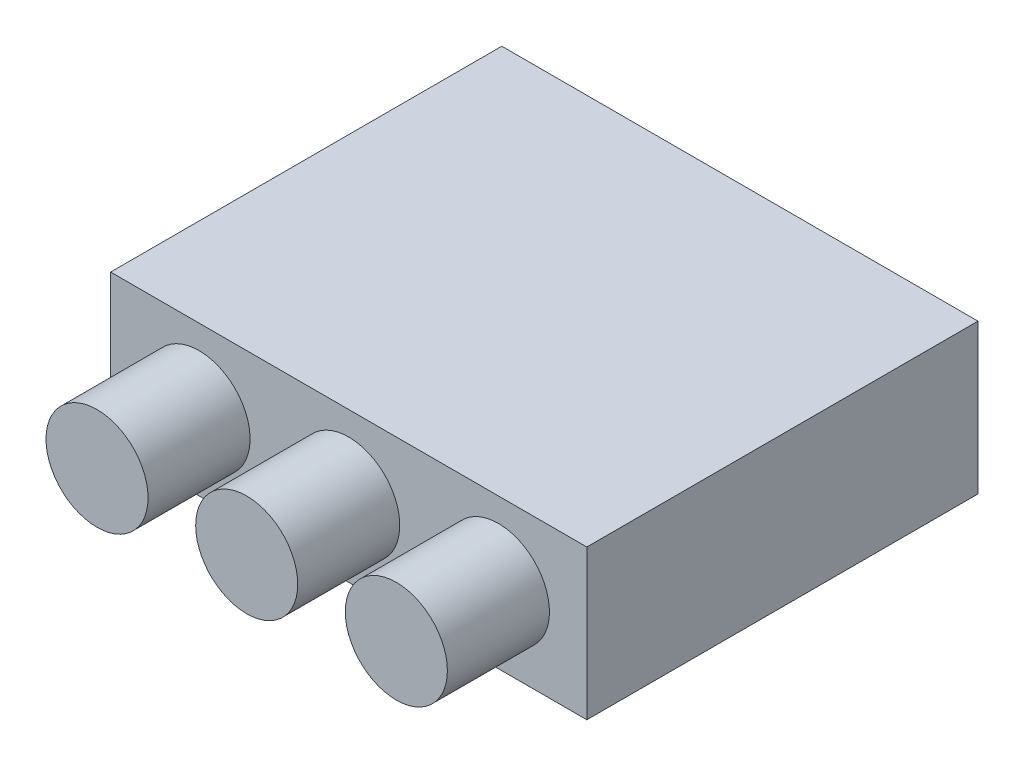
ISO-10303-21;
HEADER;
FILE_DESCRIPTION(('STEP AP214'),'2;1');
FILE_NAME('part.step','',(''),(''),'','','');
FILE_SCHEMA(('AUTOMOTIVE_DESIGN { 1 0 10303 214 1 1 1 1 }'));
ENDSEC;
DATA;
#1=APPLICATION_CONTEXT('core data for automotive mechanical design processes');
#2=APPLICATION_PROTOCOL_DEFINITION('international standard','automotive_design',2000,#1);
#3=PRODUCT_CONTEXT('',#1,'mechanical');
#4=PRODUCT('Part','Part','',(#3));
#5=PRODUCT_RELATED_PRODUCT_CATEGORY('part','',(#4));
#6=PRODUCT_DEFINITION_FORMATION('','',#4);
#7=PRODUCT_DEFINITION_CONTEXT('part definition',#1,'design');
#8=PRODUCT_DEFINITION('design','',#6,#7);
#9=PRODUCT_DEFINITION_SHAPE('','',#8);
#10=(LENGTH_UNIT() NAMED_UNIT(*) SI_UNIT(.MILLI.,.METRE.));
#11=(NAMED_UNIT(*) PLANE_ANGLE_UNIT() SI_UNIT($,.RADIAN.));
#12=(NAMED_UNIT(*) SI_UNIT($,.STERADIAN.) SOLID_ANGLE_UNIT());
#13=UNCERTAINTY_MEASURE_WITH_UNIT(LENGTH_MEASURE(1.E-05),#10,'distance_accuracy_value','');
#14=(GEOMETRIC_REPRESENTATION_CONTEXT(3) GLOBAL_UNCERTAINTY_ASSIGNED_CONTEXT((#13)) GLOBAL_UNIT_ASSIGNED_CONTEXT((#10,
#11,#12)) REPRESENTATION_CONTEXT('',''));
#15=CARTESIAN_POINT('',(0.,0.,0.));
#16=DIRECTION('',(0.,0.,1.));
#17=DIRECTION('',(1.,0.,0.));
#18=AXIS2_PLACEMENT_3D('',#15,#16,#17);
#19=CARTESIAN_POINT('',(35.,22.,-28.75));
#20=DIRECTION('',(-1.,0.,0.));
#21=DIRECTION('',(0.,0.,1.));
#22=AXIS2_PLACEMENT_3D('',#19,#20,#21);
#23=PLANE('',#22);
#24=DIRECTION('',(0.,0.,-1.));
#25=VECTOR('',#24,1.);
#26=CARTESIAN_POINT('',(35.,0.,-28.75));
#27=LINE('',#26,#25);
#28=CARTESIAN_POINT('',(35.,0.,28.75));
#29=VERTEX_POINT('',#28);
#30=CARTESIAN_POINT('',(35.,0.,-28.75));
#31=VERTEX_POINT('',#30);
#32=EDGE_CURVE('E102',#29,#31,#27,.T.);
#33=ORIENTED_EDGE('',*,*,#32,.T.);
#34=DIRECTION('',(0.,-1.,0.));
#35=VECTOR('',#34,1.);
#36=CARTESIAN_POINT('',(35.,22.,-28.75));
#37=LINE('',#36,#35);
#38=CARTESIAN_POINT('',(35.,22.,-28.75));
#39=VERTEX_POINT('',#38);
#40=EDGE_CURVE('E93',#39,#31,#37,.T.);
#41=ORIENTED_EDGE('',*,*,#40,.F.);
#42=DIRECTION('',(0.,0.,-1.));
#43=VECTOR('',#42,1.);
#44=CARTESIAN_POINT('',(35.,22.,-28.75));
#45=LINE('',#44,#43);
#46=CARTESIAN_POINT('',(35.,22.,28.75));
#47=VERTEX_POINT('',#46);
#48=EDGE_CURVE('E87',#47,#39,#45,.T.);
#49=ORIENTED_EDGE('',*,*,#48,.F.);
#50=DIRECTION('',(0.,-1.,0.));
#51=VECTOR('',#50,1.);
#52=CARTESIAN_POINT('',(35.,22.,28.75));
#53=LINE('',#52,#51);
#54=EDGE_CURVE('E98',#47,#29,#53,.T.);
#55=ORIENTED_EDGE('',*,*,#54,.T.);
#56=EDGE_LOOP('',(#33,#41,#49,#55));
#57=FACE_BOUND('',#56,.T.);
#58=ADVANCED_FACE('F35',(#57),#23,.F.);
#59=CARTESIAN_POINT('',(-35.,22.,-28.75));
#60=DIRECTION('',(0.,0.,1.));
#61=DIRECTION('',(1.,0.,0.));
#62=AXIS2_PLACEMENT_3D('',#59,#60,#61);
#63=PLANE('',#62);
#64=DIRECTION('',(-1.,0.,0.));
#65=VECTOR('',#64,1.);
#66=CARTESIAN_POINT('',(-35.,0.,-28.75));
#67=LINE('',#66,#65);
#68=CARTESIAN_POINT('',(-35.,0.,-28.75));
#69=VERTEX_POINT('',#68);
#70=EDGE_CURVE('E92',#31,#69,#67,.T.);
#71=ORIENTED_EDGE('',*,*,#70,.T.);
#72=DIRECTION('',(0.,-1.,0.));
#73=VECTOR('',#72,1.);
#74=CARTESIAN_POINT('',(-35.,22.,-28.75));
#75=LINE('',#74,#73);
#76=CARTESIAN_POINT('',(-35.,22.,-28.75));
#77=VERTEX_POINT('',#76);
#78=EDGE_CURVE('E90',#77,#69,#75,.T.);
#79=ORIENTED_EDGE('',*,*,#78,.F.);
#80=DIRECTION('',(-1.,0.,0.));
#81=VECTOR('',#80,1.);
#82=CARTESIAN_POINT('',(-35.,22.,-28.75));
#83=LINE('',#82,#81);
#84=EDGE_CURVE('E82',#39,#77,#83,.T.);
#85=ORIENTED_EDGE('',*,*,#84,.F.);
#86=ORIENTED_EDGE('',*,*,#40,.T.);
#87=EDGE_LOOP('',(#71,#79,#85,#86));
#88=FACE_BOUND('',#87,.T.);
#89=ADVANCED_FACE('F91',(#88),#63,.F.);
#90=CARTESIAN_POINT('',(-35.,22.,-28.75));
#91=DIRECTION('',(1.,0.,0.));
#92=DIRECTION('',(0.,0.,-1.));
#93=AXIS2_PLACEMENT_3D('',#90,#91,#92);
#94=PLANE('',#93);
#95=DIRECTION('',(0.,0.,1.));
#96=VECTOR('',#95,1.);
#97=CARTESIAN_POINT('',(-35.,0.,-28.75));
#98=LINE('',#97,#96);
#99=CARTESIAN_POINT('',(-35.,0.,28.75));
#100=VERTEX_POINT('',#99);
#101=EDGE_CURVE('E68',#69,#100,#98,.T.);
#102=ORIENTED_EDGE('',*,*,#101,.T.);
#103=DIRECTION('',(0.,-1.,0.));
#104=VECTOR('',#103,1.);
#105=CARTESIAN_POINT('',(-35.,22.,28.75));
#106=LINE('',#105,#104);
#107=CARTESIAN_POINT('',(-35.,22.,28.75));
#108=VERTEX_POINT('',#107);
#109=EDGE_CURVE('E94',#108,#100,#106,.T.);
#110=ORIENTED_EDGE('',*,*,#109,.F.);
#111=DIRECTION('',(0.,0.,1.));
#112=VECTOR('',#111,1.);
#113=CARTESIAN_POINT('',(-35.,22.,-28.75));
#114=LINE('',#113,#112);
#115=EDGE_CURVE('E85',#77,#108,#114,.T.);
#116=ORIENTED_EDGE('',*,*,#115,.F.);
#117=ORIENTED_EDGE('',*,*,#78,.T.);
#118=EDGE_LOOP('',(#102,#110,#116,#117));
#119=FACE_BOUND('',#118,.T.);
#120=ADVANCED_FACE('F96',(#119),#94,.F.);
#121=CARTESIAN_POINT('',(-35.,22.,28.75));
#122=DIRECTION('',(0.,0.,-1.));
#123=DIRECTION('',(-1.,0.,0.));
#124=AXIS2_PLACEMENT_3D('',#121,#122,#123);
#125=PLANE('',#124);
#126=CARTESIAN_POINT('',(22.,11.,28.75));
#127=DIRECTION('',(0.,0.,-1.));
#128=DIRECTION('',(-1.,0.,0.));
#129=AXIS2_PLACEMENT_3D('',#126,#127,#128);
#130=CIRCLE('',#129,7.5);
#131=CARTESIAN_POINT('',(14.5,11.,28.75));
#132=VERTEX_POINT('',#131);
#133=EDGE_CURVE('E11',#132,#132,#130,.F.);
#134=ORIENTED_EDGE('',*,*,#133,.F.);
#135=EDGE_LOOP('',(#134));
#136=FACE_BOUND('',#135,.T.);
#137=CARTESIAN_POINT('',(0.,11.,28.75));
#138=DIRECTION('',(0.,0.,-1.));
#139=DIRECTION('',(-1.,0.,0.));
#140=AXIS2_PLACEMENT_3D('',#137,#138,#139);
#141=CIRCLE('',#140,7.5);
#142=CARTESIAN_POINT('',(-7.5,11.,28.75));
#143=VERTEX_POINT('',#142);
#144=EDGE_CURVE('E43',#143,#143,#141,.F.);
#145=ORIENTED_EDGE('',*,*,#144,.F.);
#146=EDGE_LOOP('',(#145));
#147=FACE_BOUND('',#146,.T.);
#148=CARTESIAN_POINT('',(-22.,11.,28.75));
#149=DIRECTION('',(0.,0.,-1.));
#150=DIRECTION('',(-1.,0.,0.));
#151=AXIS2_PLACEMENT_3D('',#148,#149,#150);
#152=CIRCLE('',#151,7.5);
#153=CARTESIAN_POINT('',(-29.5,11.,28.75));
#154=VERTEX_POINT('',#153);
#155=EDGE_CURVE('E112',#154,#154,#152,.F.);
#156=ORIENTED_EDGE('',*,*,#155,.F.);
#157=EDGE_LOOP('',(#156));
#158=FACE_BOUND('',#157,.T.);
#159=DIRECTION('',(1.,0.,0.));
#160=VECTOR('',#159,1.);
#161=CARTESIAN_POINT('',(-35.,0.,28.75));
#162=LINE('',#161,#160);
#163=EDGE_CURVE('E74',#100,#29,#162,.T.);
#164=ORIENTED_EDGE('',*,*,#163,.T.);
#165=ORIENTED_EDGE('',*,*,#54,.F.);
#166=DIRECTION('',(1.,0.,0.));
#167=VECTOR('',#166,1.);
#168=CARTESIAN_POINT('',(-35.,22.,28.75));
#169=LINE('',#168,#167);
#170=EDGE_CURVE('E51',#108,#47,#169,.T.);
#171=ORIENTED_EDGE('',*,*,#170,.F.);
#172=ORIENTED_EDGE('',*,*,#109,.T.);
#173=EDGE_LOOP('',(#164,#165,#171,#172));
#174=FACE_BOUND('',#173,.T.);
#175=ADVANCED_FACE('F119',(#136,#147,#158,#174),#125,.F.);
#176=CARTESIAN_POINT('',(0.,22.,0.));
#177=DIRECTION('',(0.,1.,0.));
#178=DIRECTION('',(0.,0.,1.));
#179=AXIS2_PLACEMENT_3D('',#176,#177,#178);
#180=PLANE('',#179);
#181=ORIENTED_EDGE('',*,*,#48,.T.);
#182=ORIENTED_EDGE('',*,*,#84,.T.);
#183=ORIENTED_EDGE('',*,*,#115,.T.);
#184=ORIENTED_EDGE('',*,*,#170,.T.);
#185=EDGE_LOOP('',(#181,#182,#183,#184));
#186=FACE_BOUND('',#185,.T.);
#187=ADVANCED_FACE('F83',(#186),#180,.T.);
#188=CARTESIAN_POINT('',(0.,0.,0.));
#189=DIRECTION('',(0.,1.,0.));
#190=DIRECTION('',(0.,0.,1.));
#191=AXIS2_PLACEMENT_3D('',#188,#189,#190);
#192=PLANE('',#191);
#193=CARTESIAN_POINT('',(32.,0.,25.));
#194=DIRECTION('',(0.,-1.,0.));
#195=DIRECTION('',(0.,0.,-1.));
#196=AXIS2_PLACEMENT_3D('',#193,#194,#195);
#197=CIRCLE('',#196,0.999999999999998);
#198=CARTESIAN_POINT('',(32.,0.,24.));
#199=VERTEX_POINT('',#198);
#200=EDGE_CURVE('E165',#199,#199,#197,.T.);
#201=ORIENTED_EDGE('',*,*,#200,.F.);
#202=EDGE_LOOP('',(#201));
#203=FACE_BOUND('',#202,.T.);
#204=CARTESIAN_POINT('',(32.,0.,-25.));
#205=DIRECTION('',(0.,-1.,0.));
#206=DIRECTION('',(0.,0.,-1.));
#207=AXIS2_PLACEMENT_3D('',#204,#205,#206);
#208=CIRCLE('',#207,0.999999999999998);
#209=CARTESIAN_POINT('',(32.,0.,-26.));
#210=VERTEX_POINT('',#209);
#211=EDGE_CURVE('E171',#210,#210,#208,.T.);
#212=ORIENTED_EDGE('',*,*,#211,.F.);
#213=EDGE_LOOP('',(#212));
#214=FACE_BOUND('',#213,.T.);
#215=CARTESIAN_POINT('',(-32.,0.,-25.));
#216=DIRECTION('',(0.,-1.,0.));
#217=DIRECTION('',(0.,0.,-1.));
#218=AXIS2_PLACEMENT_3D('',#215,#216,#217);
#219=CIRCLE('',#218,0.999999999999998);
#220=CARTESIAN_POINT('',(-32.,0.,-26.));
#221=VERTEX_POINT('',#220);
#222=EDGE_CURVE('E177',#221,#221,#219,.T.);
#223=ORIENTED_EDGE('',*,*,#222,.F.);
#224=EDGE_LOOP('',(#223));
#225=FACE_BOUND('',#224,.T.);
#226=CARTESIAN_POINT('',(-32.,0.,25.));
#227=DIRECTION('',(0.,-1.,0.));
#228=DIRECTION('',(0.,0.,-1.));
#229=AXIS2_PLACEMENT_3D('',#226,#227,#228);
#230=CIRCLE('',#229,0.999999999999998);
#231=CARTESIAN_POINT('',(-32.,0.,24.));
#232=VERTEX_POINT('',#231);
#233=EDGE_CURVE('E159',#232,#232,#230,.T.);
#234=ORIENTED_EDGE('',*,*,#233,.F.);
#235=EDGE_LOOP('',(#234));
#236=FACE_BOUND('',#235,.T.);
#237=ORIENTED_EDGE('',*,*,#32,.F.);
#238=ORIENTED_EDGE('',*,*,#163,.F.);
#239=ORIENTED_EDGE('',*,*,#101,.F.);
#240=ORIENTED_EDGE('',*,*,#70,.F.);
#241=EDGE_LOOP('',(#237,#238,#239,#240));
#242=FACE_BOUND('',#241,.T.);
#243=ADVANCED_FACE('F129',(#203,#214,#225,#236,#242),#192,.F.);
#244=CARTESIAN_POINT('',(-22.,11.,43.75));
#245=DIRECTION('',(0.,0.,-1.));
#246=DIRECTION('',(-1.,0.,0.));
#247=AXIS2_PLACEMENT_3D('',#244,#245,#246);
#248=CYLINDRICAL_SURFACE('',#247,7.5);
#249=CARTESIAN_POINT('',(-22.,11.,43.75));
#250=DIRECTION('',(0.,0.,1.));
#251=DIRECTION('',(1.,0.,0.));
#252=AXIS2_PLACEMENT_3D('',#249,#250,#251);
#253=CIRCLE('',#252,7.5);
#254=CARTESIAN_POINT('',(-14.5,11.,43.75));
#255=VERTEX_POINT('',#254);
#256=EDGE_CURVE('E105',#255,#255,#253,.T.);
#257=ORIENTED_EDGE('',*,*,#256,.F.);
#258=EDGE_LOOP('',(#257));
#259=FACE_BOUND('',#258,.T.);
#260=ORIENTED_EDGE('',*,*,#155,.T.);
#261=EDGE_LOOP('',(#260));
#262=FACE_BOUND('',#261,.T.);
#263=ADVANCED_FACE('F126',(#259,#262),#248,.T.);
#264=CARTESIAN_POINT('',(-22.,11.,43.75));
#265=DIRECTION('',(0.,0.,1.));
#266=DIRECTION('',(1.,0.,0.));
#267=AXIS2_PLACEMENT_3D('',#264,#265,#266);
#268=PLANE('',#267);
#269=ORIENTED_EDGE('',*,*,#256,.T.);
#270=EDGE_LOOP('',(#269));
#271=FACE_BOUND('',#270,.T.);
#272=ADVANCED_FACE('F128',(#271),#268,.T.);
#273=CARTESIAN_POINT('',(0.,11.,43.75));
#274=DIRECTION('',(0.,0.,-1.));
#275=DIRECTION('',(-1.,0.,0.));
#276=AXIS2_PLACEMENT_3D('',#273,#274,#275);
#277=CYLINDRICAL_SURFACE('',#276,7.5);
#278=CARTESIAN_POINT('',(0.,11.,43.75));
#279=DIRECTION('',(0.,0.,1.));
#280=DIRECTION('',(1.,0.,0.));
#281=AXIS2_PLACEMENT_3D('',#278,#279,#280);
#282=CIRCLE('',#281,7.5);
#283=CARTESIAN_POINT('',(7.5,11.,43.75));
#284=VERTEX_POINT('',#283);
#285=EDGE_CURVE('E152',#284,#284,#282,.T.);
#286=ORIENTED_EDGE('',*,*,#285,.F.);
#287=EDGE_LOOP('',(#286));
#288=FACE_BOUND('',#287,.T.);
#289=ORIENTED_EDGE('',*,*,#144,.T.);
#290=EDGE_LOOP('',(#289));
#291=FACE_BOUND('',#290,.T.);
#292=ADVANCED_FACE('F117',(#288,#291),#277,.T.);
#293=CARTESIAN_POINT('',(0.,11.,43.75));
#294=DIRECTION('',(0.,0.,1.));
#295=DIRECTION('',(1.,0.,0.));
#296=AXIS2_PLACEMENT_3D('',#293,#294,#295);
#297=PLANE('',#296);
#298=ORIENTED_EDGE('',*,*,#285,.T.);
#299=EDGE_LOOP('',(#298));
#300=FACE_BOUND('',#299,.T.);
#301=ADVANCED_FACE('F214',(#300),#297,.T.);
#302=CARTESIAN_POINT('',(22.,11.,43.75));
#303=DIRECTION('',(0.,0.,-1.));
#304=DIRECTION('',(-1.,0.,0.));
#305=AXIS2_PLACEMENT_3D('',#302,#303,#304);
#306=CYLINDRICAL_SURFACE('',#305,7.5);
#307=CARTESIAN_POINT('',(22.,11.,43.75));
#308=DIRECTION('',(0.,0.,1.));
#309=DIRECTION('',(1.,0.,0.));
#310=AXIS2_PLACEMENT_3D('',#307,#308,#309);
#311=CIRCLE('',#310,7.5);
#312=CARTESIAN_POINT('',(29.5,11.,43.75));
#313=VERTEX_POINT('',#312);
#314=EDGE_CURVE('E155',#313,#313,#311,.T.);
#315=ORIENTED_EDGE('',*,*,#314,.F.);
#316=EDGE_LOOP('',(#315));
#317=FACE_BOUND('',#316,.T.);
#318=ORIENTED_EDGE('',*,*,#133,.T.);
#319=EDGE_LOOP('',(#318));
#320=FACE_BOUND('',#319,.T.);
#321=ADVANCED_FACE('F206',(#317,#320),#306,.T.);
#322=CARTESIAN_POINT('',(22.,11.,43.75));
#323=DIRECTION('',(0.,0.,1.));
#324=DIRECTION('',(1.,0.,0.));
#325=AXIS2_PLACEMENT_3D('',#322,#323,#324);
#326=PLANE('',#325);
#327=ORIENTED_EDGE('',*,*,#314,.T.);
#328=EDGE_LOOP('',(#327));
#329=FACE_BOUND('',#328,.T.);
#330=ADVANCED_FACE('F197',(#329),#326,.T.);
#331=CARTESIAN_POINT('',(-32.,5.,25.));
#332=DIRECTION('',(0.,-1.,0.));
#333=DIRECTION('',(0.,0.,-1.));
#334=AXIS2_PLACEMENT_3D('',#331,#332,#333);
#335=CYLINDRICAL_SURFACE('',#334,0.999999999999998);
#336=CARTESIAN_POINT('',(-32.,5.,25.));
#337=DIRECTION('',(0.,-1.,0.));
#338=DIRECTION('',(0.,0.,-1.));
#339=AXIS2_PLACEMENT_3D('',#336,#337,#338);
#340=CIRCLE('',#339,0.999999999999998);
#341=CARTESIAN_POINT('',(-32.,5.,24.));
#342=VERTEX_POINT('',#341);
#343=EDGE_CURVE('E158',#342,#342,#340,.T.);
#344=ORIENTED_EDGE('',*,*,#343,.F.);
#345=EDGE_LOOP('',(#344));
#346=FACE_BOUND('',#345,.T.);
#347=ORIENTED_EDGE('',*,*,#233,.T.);
#348=EDGE_LOOP('',(#347));
#349=FACE_BOUND('',#348,.T.);
#350=ADVANCED_FACE('F195',(#346,#349),#335,.F.);
#351=CARTESIAN_POINT('',(-32.,5.,25.));
#352=DIRECTION('',(0.,-1.,0.));
#353=DIRECTION('',(0.,0.,-1.));
#354=AXIS2_PLACEMENT_3D('',#351,#352,#353);
#355=PLANE('',#354);
#356=ORIENTED_EDGE('',*,*,#343,.T.);
#357=EDGE_LOOP('',(#356));
#358=FACE_BOUND('',#357,.T.);
#359=ADVANCED_FACE('F188',(#358),#355,.T.);
#360=CARTESIAN_POINT('',(-32.,5.,-25.));
#361=DIRECTION('',(0.,-1.,0.));
#362=DIRECTION('',(0.,0.,-1.));
#363=AXIS2_PLACEMENT_3D('',#360,#361,#362);
#364=CYLINDRICAL_SURFACE('',#363,0.999999999999998);
#365=CARTESIAN_POINT('',(-32.,5.,-25.));
#366=DIRECTION('',(0.,-1.,0.));
#367=DIRECTION('',(0.,0.,-1.));
#368=AXIS2_PLACEMENT_3D('',#365,#366,#367);
#369=CIRCLE('',#368,0.999999999999998);
#370=CARTESIAN_POINT('',(-32.,5.,-26.));
#371=VERTEX_POINT('',#370);
#372=EDGE_CURVE('E162',#371,#371,#369,.T.);
#373=ORIENTED_EDGE('',*,*,#372,.F.);
#374=EDGE_LOOP('',(#373));
#375=FACE_BOUND('',#374,.T.);
#376=ORIENTED_EDGE('',*,*,#222,.T.);
#377=EDGE_LOOP('',(#376));
#378=FACE_BOUND('',#377,.T.);
#379=ADVANCED_FACE('F185',(#375,#378),#364,.F.);
#380=CARTESIAN_POINT('',(-32.,5.,-25.));
#381=DIRECTION('',(0.,-1.,0.));
#382=DIRECTION('',(0.,0.,-1.));
#383=AXIS2_PLACEMENT_3D('',#380,#381,#382);
#384=PLANE('',#383);
#385=ORIENTED_EDGE('',*,*,#372,.T.);
#386=EDGE_LOOP('',(#385));
#387=FACE_BOUND('',#386,.T.);
#388=ADVANCED_FACE('F183',(#387),#384,.T.);
#389=CARTESIAN_POINT('',(32.,5.,-25.));
#390=DIRECTION('',(0.,-1.,0.));
#391=DIRECTION('',(0.,0.,-1.));
#392=AXIS2_PLACEMENT_3D('',#389,#390,#391);
#393=CYLINDRICAL_SURFACE('',#392,0.999999999999998);
#394=CARTESIAN_POINT('',(32.,5.,-25.));
#395=DIRECTION('',(0.,-1.,0.));
#396=DIRECTION('',(0.,0.,-1.));
#397=AXIS2_PLACEMENT_3D('',#394,#395,#396);
#398=CIRCLE('',#397,0.999999999999998);
#399=CARTESIAN_POINT('',(32.,5.,-26.));
#400=VERTEX_POINT('',#399);
#401=EDGE_CURVE('E174',#400,#400,#398,.T.);
#402=ORIENTED_EDGE('',*,*,#401,.F.);
#403=EDGE_LOOP('',(#402));
#404=FACE_BOUND('',#403,.T.);
#405=ORIENTED_EDGE('',*,*,#211,.T.);
#406=EDGE_LOOP('',(#405));
#407=FACE_BOUND('',#406,.T.);
#408=ADVANCED_FACE('F272',(#404,#407),#393,.F.);
#409=CARTESIAN_POINT('',(32.,5.,-25.));
#410=DIRECTION('',(0.,-1.,0.));
#411=DIRECTION('',(0.,0.,-1.));
#412=AXIS2_PLACEMENT_3D('',#409,#410,#411);
#413=PLANE('',#412);
#414=ORIENTED_EDGE('',*,*,#401,.T.);
#415=EDGE_LOOP('',(#414));
#416=FACE_BOUND('',#415,.T.);
#417=ADVANCED_FACE('F281',(#416),#413,.T.);
#418=CARTESIAN_POINT('',(32.,5.,25.));
#419=DIRECTION('',(0.,-1.,0.));
#420=DIRECTION('',(0.,0.,-1.));
#421=AXIS2_PLACEMENT_3D('',#418,#419,#420);
#422=CYLINDRICAL_SURFACE('',#421,0.999999999999998);
#423=CARTESIAN_POINT('',(32.,5.,25.));
#424=DIRECTION('',(0.,-1.,0.));
#425=DIRECTION('',(0.,0.,-1.));
#426=AXIS2_PLACEMENT_3D('',#423,#424,#425);
#427=CIRCLE('',#426,0.999999999999998);
#428=CARTESIAN_POINT('',(32.,5.,24.));
#429=VERTEX_POINT('',#428);
#430=EDGE_CURVE('E168',#429,#429,#427,.T.);
#431=ORIENTED_EDGE('',*,*,#430,.F.);
#432=EDGE_LOOP('',(#431));
#433=FACE_BOUND('',#432,.T.);
#434=ORIENTED_EDGE('',*,*,#200,.T.);
#435=EDGE_LOOP('',(#434));
#436=FACE_BOUND('',#435,.T.);
#437=ADVANCED_FACE('F291',(#433,#436),#422,.F.);
#438=CARTESIAN_POINT('',(32.,5.,25.));
#439=DIRECTION('',(0.,-1.,0.));
#440=DIRECTION('',(0.,0.,-1.));
#441=AXIS2_PLACEMENT_3D('',#438,#439,#440);
#442=PLANE('',#441);
#443=ORIENTED_EDGE('',*,*,#430,.T.);
#444=EDGE_LOOP('',(#443));
#445=FACE_BOUND('',#444,.T.);
#446=ADVANCED_FACE('F301',(#445),#442,.T.);
#447=CLOSED_SHELL('',(#58,#89,#120,#175,#187,#243,#263,#272,#292,#301,#321,#330,#350,#359,#379,
#388,#408,#417,#437,#446));
#448=MANIFOLD_SOLID_BREP('B2',#447);
#449=ADVANCED_BREP_SHAPE_REPRESENTATION('',(#18,#448),#14);
#450=SHAPE_DEFINITION_REPRESENTATION(#9,#449);
ENDSEC;
END-ISO-10303-21;
